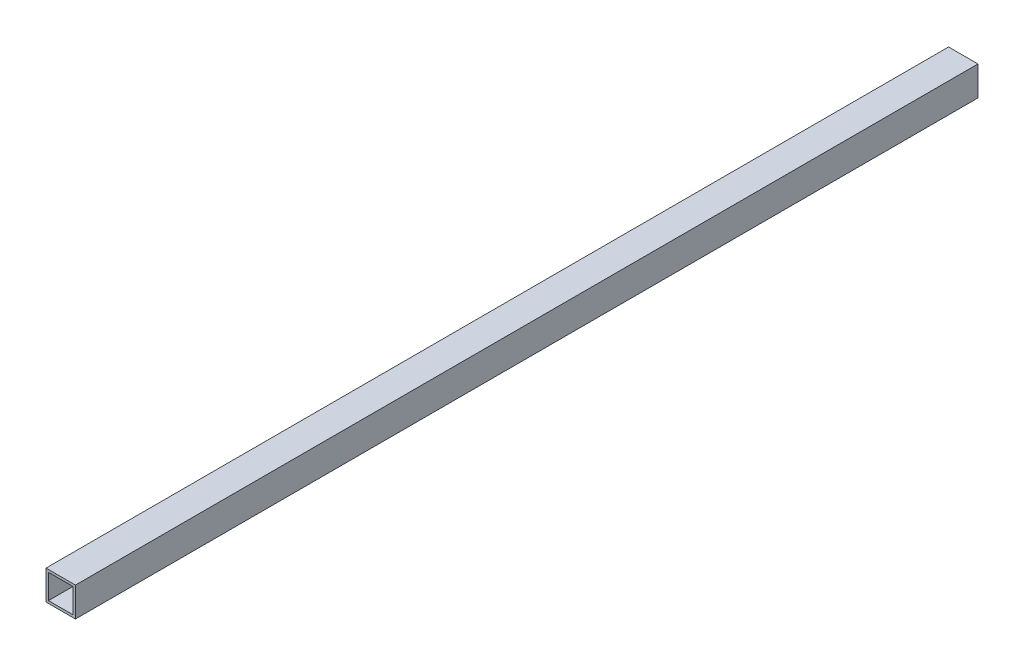
ISO-10303-21;
HEADER;
FILE_DESCRIPTION(('STEP AP214'),'2;1');
FILE_NAME('part.step','',(''),(''),'','','');
FILE_SCHEMA(('AUTOMOTIVE_DESIGN { 1 0 10303 214 1 1 1 1 }'));
ENDSEC;
DATA;
#1=APPLICATION_CONTEXT('core data for automotive mechanical design processes');
#2=APPLICATION_PROTOCOL_DEFINITION('international standard','automotive_design',2000,#1);
#3=PRODUCT_CONTEXT('',#1,'mechanical');
#4=PRODUCT('Part','Part','',(#3));
#5=PRODUCT_RELATED_PRODUCT_CATEGORY('part','',(#4));
#6=PRODUCT_DEFINITION_FORMATION('','',#4);
#7=PRODUCT_DEFINITION_CONTEXT('part definition',#1,'design');
#8=PRODUCT_DEFINITION('design','',#6,#7);
#9=PRODUCT_DEFINITION_SHAPE('','',#8);
#10=(LENGTH_UNIT() NAMED_UNIT(*) SI_UNIT(.MILLI.,.METRE.));
#11=(NAMED_UNIT(*) PLANE_ANGLE_UNIT() SI_UNIT($,.RADIAN.));
#12=(NAMED_UNIT(*) SI_UNIT($,.STERADIAN.) SOLID_ANGLE_UNIT());
#13=UNCERTAINTY_MEASURE_WITH_UNIT(LENGTH_MEASURE(1.E-05),#10,'distance_accuracy_value','');
#14=(GEOMETRIC_REPRESENTATION_CONTEXT(3) GLOBAL_UNCERTAINTY_ASSIGNED_CONTEXT((#13)) GLOBAL_UNIT_ASSIGNED_CONTEXT((#10,
#11,#12)) REPRESENTATION_CONTEXT('',''));
#15=CARTESIAN_POINT('',(0.,0.,0.));
#16=DIRECTION('',(0.,0.,1.));
#17=DIRECTION('',(1.,0.,0.));
#18=AXIS2_PLACEMENT_3D('',#15,#16,#17);
#19=CARTESIAN_POINT('',(-10.259093804746,14.9139194139194,584.2));
#20=DIRECTION('',(0.,1.,0.));
#21=DIRECTION('',(0.,0.,1.));
#22=AXIS2_PLACEMENT_3D('',#19,#20,#21);
#23=PLANE('',#22);
#24=DIRECTION('',(1.,0.,0.));
#25=VECTOR('',#24,1.);
#26=CARTESIAN_POINT('',(-10.259093804746,14.9139194139194,0.));
#27=LINE('',#26,#25);
#28=CARTESIAN_POINT('',(-10.259093804746,14.9139194139194,0.));
#29=VERTEX_POINT('',#28);
#30=CARTESIAN_POINT('',(8.79090619525399,14.9139194139194,0.));
#31=VERTEX_POINT('',#30);
#32=EDGE_CURVE('E131',#29,#31,#27,.T.);
#33=ORIENTED_EDGE('',*,*,#32,.F.);
#34=DIRECTION('',(0.,0.,-1.));
#35=VECTOR('',#34,1.);
#36=CARTESIAN_POINT('',(-10.259093804746,14.9139194139194,584.2));
#37=LINE('',#36,#35);
#38=CARTESIAN_POINT('',(-10.259093804746,14.9139194139194,584.2));
#39=VERTEX_POINT('',#38);
#40=EDGE_CURVE('E11',#39,#29,#37,.T.);
#41=ORIENTED_EDGE('',*,*,#40,.F.);
#42=DIRECTION('',(1.,0.,0.));
#43=VECTOR('',#42,1.);
#44=CARTESIAN_POINT('',(-10.259093804746,14.9139194139194,584.2));
#45=LINE('',#44,#43);
#46=CARTESIAN_POINT('',(8.79090619525399,14.9139194139194,584.2));
#47=VERTEX_POINT('',#46);
#48=EDGE_CURVE('E135',#39,#47,#45,.T.);
#49=ORIENTED_EDGE('',*,*,#48,.T.);
#50=DIRECTION('',(0.,0.,-1.));
#51=VECTOR('',#50,1.);
#52=CARTESIAN_POINT('',(8.79090619525399,14.9139194139194,584.2));
#53=LINE('',#52,#51);
#54=EDGE_CURVE('E36',#47,#31,#53,.T.);
#55=ORIENTED_EDGE('',*,*,#54,.T.);
#56=EDGE_LOOP('',(#33,#41,#49,#55));
#57=FACE_BOUND('',#56,.T.);
#58=ADVANCED_FACE('F33',(#57),#23,.T.);
#59=CARTESIAN_POINT('',(-10.259093804746,14.9139194139194,584.2));
#60=DIRECTION('',(1.,0.,0.));
#61=DIRECTION('',(0.,1.,0.));
#62=AXIS2_PLACEMENT_3D('',#59,#60,#61);
#63=PLANE('',#62);
#64=DIRECTION('',(0.,-1.,0.));
#65=VECTOR('',#64,1.);
#66=CARTESIAN_POINT('',(-10.259093804746,14.9139194139194,0.));
#67=LINE('',#66,#65);
#68=CARTESIAN_POINT('',(-10.259093804746,-4.13608058608059,0.));
#69=VERTEX_POINT('',#68);
#70=EDGE_CURVE('E139',#29,#69,#67,.T.);
#71=ORIENTED_EDGE('',*,*,#70,.T.);
#72=DIRECTION('',(0.,0.,-1.));
#73=VECTOR('',#72,1.);
#74=CARTESIAN_POINT('',(-10.259093804746,-4.13608058608059,584.2));
#75=LINE('',#74,#73);
#76=CARTESIAN_POINT('',(-10.259093804746,-4.13608058608059,584.2));
#77=VERTEX_POINT('',#76);
#78=EDGE_CURVE('E41',#77,#69,#75,.T.);
#79=ORIENTED_EDGE('',*,*,#78,.F.);
#80=DIRECTION('',(0.,-1.,0.));
#81=VECTOR('',#80,1.);
#82=CARTESIAN_POINT('',(-10.259093804746,14.9139194139194,584.2));
#83=LINE('',#82,#81);
#84=EDGE_CURVE('E144',#39,#77,#83,.T.);
#85=ORIENTED_EDGE('',*,*,#84,.F.);
#86=ORIENTED_EDGE('',*,*,#40,.T.);
#87=EDGE_LOOP('',(#71,#79,#85,#86));
#88=FACE_BOUND('',#87,.T.);
#89=ADVANCED_FACE('F171',(#88),#63,.F.);
#90=CARTESIAN_POINT('',(-10.259093804746,-4.13608058608059,584.2));
#91=DIRECTION('',(0.,1.,0.));
#92=DIRECTION('',(-1.,0.,0.));
#93=AXIS2_PLACEMENT_3D('',#90,#91,#92);
#94=PLANE('',#93);
#95=DIRECTION('',(1.,0.,0.));
#96=VECTOR('',#95,1.);
#97=CARTESIAN_POINT('',(-10.259093804746,-4.13608058608059,0.));
#98=LINE('',#97,#96);
#99=CARTESIAN_POINT('',(8.790906195254,-4.13608058608059,0.));
#100=VERTEX_POINT('',#99);
#101=EDGE_CURVE('E151',#69,#100,#98,.T.);
#102=ORIENTED_EDGE('',*,*,#101,.T.);
#103=DIRECTION('',(0.,0.,-1.));
#104=VECTOR('',#103,1.);
#105=CARTESIAN_POINT('',(8.790906195254,-4.13608058608059,584.2));
#106=LINE('',#105,#104);
#107=CARTESIAN_POINT('',(8.790906195254,-4.13608058608059,584.2));
#108=VERTEX_POINT('',#107);
#109=EDGE_CURVE('E156',#108,#100,#106,.T.);
#110=ORIENTED_EDGE('',*,*,#109,.F.);
#111=DIRECTION('',(1.,0.,0.));
#112=VECTOR('',#111,1.);
#113=CARTESIAN_POINT('',(-10.259093804746,-4.13608058608059,584.2));
#114=LINE('',#113,#112);
#115=EDGE_CURVE('E142',#77,#108,#114,.T.);
#116=ORIENTED_EDGE('',*,*,#115,.F.);
#117=ORIENTED_EDGE('',*,*,#78,.T.);
#118=EDGE_LOOP('',(#102,#110,#116,#117));
#119=FACE_BOUND('',#118,.T.);
#120=ADVANCED_FACE('F175',(#119),#94,.F.);
#121=CARTESIAN_POINT('',(8.79090619525399,14.9139194139194,584.2));
#122=DIRECTION('',(1.,0.,0.));
#123=DIRECTION('',(0.,1.,0.));
#124=AXIS2_PLACEMENT_3D('',#121,#122,#123);
#125=PLANE('',#124);
#126=DIRECTION('',(0.,-1.,0.));
#127=VECTOR('',#126,1.);
#128=CARTESIAN_POINT('',(8.79090619525399,14.9139194139194,0.));
#129=LINE('',#128,#127);
#130=EDGE_CURVE('E148',#31,#100,#129,.T.);
#131=ORIENTED_EDGE('',*,*,#130,.F.);
#132=ORIENTED_EDGE('',*,*,#54,.F.);
#133=DIRECTION('',(0.,-1.,0.));
#134=VECTOR('',#133,1.);
#135=CARTESIAN_POINT('',(8.79090619525399,14.9139194139194,584.2));
#136=LINE('',#135,#134);
#137=EDGE_CURVE('E138',#47,#108,#136,.T.);
#138=ORIENTED_EDGE('',*,*,#137,.T.);
#139=ORIENTED_EDGE('',*,*,#109,.T.);
#140=EDGE_LOOP('',(#131,#132,#138,#139));
#141=FACE_BOUND('',#140,.T.);
#142=ADVANCED_FACE('F164',(#141),#125,.T.);
#143=CARTESIAN_POINT('',(0.,0.,584.2));
#144=DIRECTION('',(0.,0.,-1.));
#145=DIRECTION('',(-1.,0.,0.));
#146=AXIS2_PLACEMENT_3D('',#143,#144,#145);
#147=PLANE('',#146);
#148=DIRECTION('',(-1.,0.,0.));
#149=VECTOR('',#148,1.);
#150=CARTESIAN_POINT('',(7.203406195254,-2.54858058608059,584.2));
#151=LINE('',#150,#149);
#152=CARTESIAN_POINT('',(7.203406195254,-2.54858058608059,584.2));
#153=VERTEX_POINT('',#152);
#154=CARTESIAN_POINT('',(-8.671593804746,-2.54858058608059,584.2));
#155=VERTEX_POINT('',#154);
#156=EDGE_CURVE('E106',#153,#155,#151,.T.);
#157=ORIENTED_EDGE('',*,*,#156,.T.);
#158=DIRECTION('',(0.,1.,0.));
#159=VECTOR('',#158,1.);
#160=CARTESIAN_POINT('',(-8.671593804746,-2.54858058608059,584.2));
#161=LINE('',#160,#159);
#162=CARTESIAN_POINT('',(-8.67159380474601,13.3264194139194,584.2));
#163=VERTEX_POINT('',#162);
#164=EDGE_CURVE('E100',#155,#163,#161,.T.);
#165=ORIENTED_EDGE('',*,*,#164,.T.);
#166=DIRECTION('',(1.,0.,0.));
#167=VECTOR('',#166,1.);
#168=CARTESIAN_POINT('',(-8.67159380474601,13.3264194139194,584.2));
#169=LINE('',#168,#167);
#170=CARTESIAN_POINT('',(7.20340619525399,13.3264194139194,584.2));
#171=VERTEX_POINT('',#170);
#172=EDGE_CURVE('E109',#163,#171,#169,.T.);
#173=ORIENTED_EDGE('',*,*,#172,.T.);
#174=DIRECTION('',(0.,-1.,0.));
#175=VECTOR('',#174,1.);
#176=CARTESIAN_POINT('',(7.20340619525399,13.3264194139194,584.2));
#177=LINE('',#176,#175);
#178=EDGE_CURVE('E49',#171,#153,#177,.T.);
#179=ORIENTED_EDGE('',*,*,#178,.T.);
#180=EDGE_LOOP('',(#157,#165,#173,#179));
#181=FACE_BOUND('',#180,.T.);
#182=ORIENTED_EDGE('',*,*,#48,.F.);
#183=ORIENTED_EDGE('',*,*,#84,.T.);
#184=ORIENTED_EDGE('',*,*,#115,.T.);
#185=ORIENTED_EDGE('',*,*,#137,.F.);
#186=EDGE_LOOP('',(#182,#183,#184,#185));
#187=FACE_BOUND('',#186,.T.);
#188=ADVANCED_FACE('F113',(#181,#187),#147,.F.);
#189=CARTESIAN_POINT('',(0.,0.,0.));
#190=DIRECTION('',(0.,0.,-1.));
#191=DIRECTION('',(-1.,0.,0.));
#192=AXIS2_PLACEMENT_3D('',#189,#190,#191);
#193=PLANE('',#192);
#194=DIRECTION('',(0.,1.,0.));
#195=VECTOR('',#194,1.);
#196=CARTESIAN_POINT('',(-8.671593804746,-2.54858058608059,0.));
#197=LINE('',#196,#195);
#198=CARTESIAN_POINT('',(-8.671593804746,-2.54858058608059,0.));
#199=VERTEX_POINT('',#198);
#200=CARTESIAN_POINT('',(-8.67159380474601,13.3264194139194,0.));
#201=VERTEX_POINT('',#200);
#202=EDGE_CURVE('E57',#199,#201,#197,.T.);
#203=ORIENTED_EDGE('',*,*,#202,.F.);
#204=DIRECTION('',(-1.,0.,0.));
#205=VECTOR('',#204,1.);
#206=CARTESIAN_POINT('',(7.203406195254,-2.54858058608059,0.));
#207=LINE('',#206,#205);
#208=CARTESIAN_POINT('',(7.203406195254,-2.54858058608059,0.));
#209=VERTEX_POINT('',#208);
#210=EDGE_CURVE('E116',#209,#199,#207,.T.);
#211=ORIENTED_EDGE('',*,*,#210,.F.);
#212=DIRECTION('',(0.,-1.,0.));
#213=VECTOR('',#212,1.);
#214=CARTESIAN_POINT('',(7.20340619525399,13.3264194139194,0.));
#215=LINE('',#214,#213);
#216=CARTESIAN_POINT('',(7.20340619525399,13.3264194139194,0.));
#217=VERTEX_POINT('',#216);
#218=EDGE_CURVE('E119',#217,#209,#215,.T.);
#219=ORIENTED_EDGE('',*,*,#218,.F.);
#220=DIRECTION('',(1.,0.,0.));
#221=VECTOR('',#220,1.);
#222=CARTESIAN_POINT('',(-8.67159380474601,13.3264194139194,0.));
#223=LINE('',#222,#221);
#224=EDGE_CURVE('E125',#201,#217,#223,.T.);
#225=ORIENTED_EDGE('',*,*,#224,.F.);
#226=EDGE_LOOP('',(#203,#211,#219,#225));
#227=FACE_BOUND('',#226,.T.);
#228=ORIENTED_EDGE('',*,*,#32,.T.);
#229=ORIENTED_EDGE('',*,*,#130,.T.);
#230=ORIENTED_EDGE('',*,*,#101,.F.);
#231=ORIENTED_EDGE('',*,*,#70,.F.);
#232=EDGE_LOOP('',(#228,#229,#230,#231));
#233=FACE_BOUND('',#232,.T.);
#234=ADVANCED_FACE('F168',(#227,#233),#193,.T.);
#235=CARTESIAN_POINT('',(-8.671593804746,-2.54858058608059,584.2));
#236=DIRECTION('',(-1.,0.,0.));
#237=DIRECTION('',(0.,-1.,0.));
#238=AXIS2_PLACEMENT_3D('',#235,#236,#237);
#239=PLANE('',#238);
#240=ORIENTED_EDGE('',*,*,#202,.T.);
#241=DIRECTION('',(0.,0.,-1.));
#242=VECTOR('',#241,1.);
#243=CARTESIAN_POINT('',(-8.67159380474601,13.3264194139194,584.2));
#244=LINE('',#243,#242);
#245=EDGE_CURVE('E96',#163,#201,#244,.T.);
#246=ORIENTED_EDGE('',*,*,#245,.F.);
#247=ORIENTED_EDGE('',*,*,#164,.F.);
#248=DIRECTION('',(0.,0.,-1.));
#249=VECTOR('',#248,1.);
#250=CARTESIAN_POINT('',(-8.671593804746,-2.54858058608059,584.2));
#251=LINE('',#250,#249);
#252=EDGE_CURVE('E129',#155,#199,#251,.T.);
#253=ORIENTED_EDGE('',*,*,#252,.T.);
#254=EDGE_LOOP('',(#240,#246,#247,#253));
#255=FACE_BOUND('',#254,.T.);
#256=ADVANCED_FACE('F98',(#255),#239,.F.);
#257=CARTESIAN_POINT('',(7.203406195254,-2.54858058608059,584.2));
#258=DIRECTION('',(0.,-1.,0.));
#259=DIRECTION('',(1.,0.,0.));
#260=AXIS2_PLACEMENT_3D('',#257,#258,#259);
#261=PLANE('',#260);
#262=ORIENTED_EDGE('',*,*,#210,.T.);
#263=ORIENTED_EDGE('',*,*,#252,.F.);
#264=ORIENTED_EDGE('',*,*,#156,.F.);
#265=DIRECTION('',(0.,0.,-1.));
#266=VECTOR('',#265,1.);
#267=CARTESIAN_POINT('',(7.203406195254,-2.54858058608059,584.2));
#268=LINE('',#267,#266);
#269=EDGE_CURVE('E132',#153,#209,#268,.T.);
#270=ORIENTED_EDGE('',*,*,#269,.T.);
#271=EDGE_LOOP('',(#262,#263,#264,#270));
#272=FACE_BOUND('',#271,.T.);
#273=ADVANCED_FACE('F219',(#272),#261,.F.);
#274=CARTESIAN_POINT('',(7.20340619525399,13.3264194139194,584.2));
#275=DIRECTION('',(1.,0.,0.));
#276=DIRECTION('',(0.,1.,0.));
#277=AXIS2_PLACEMENT_3D('',#274,#275,#276);
#278=PLANE('',#277);
#279=ORIENTED_EDGE('',*,*,#218,.T.);
#280=ORIENTED_EDGE('',*,*,#269,.F.);
#281=ORIENTED_EDGE('',*,*,#178,.F.);
#282=DIRECTION('',(0.,0.,-1.));
#283=VECTOR('',#282,1.);
#284=CARTESIAN_POINT('',(7.20340619525399,13.3264194139194,584.2));
#285=LINE('',#284,#283);
#286=EDGE_CURVE('E105',#171,#217,#285,.T.);
#287=ORIENTED_EDGE('',*,*,#286,.T.);
#288=EDGE_LOOP('',(#279,#280,#281,#287));
#289=FACE_BOUND('',#288,.T.);
#290=ADVANCED_FACE('F227',(#289),#278,.F.);
#291=CARTESIAN_POINT('',(-8.67159380474601,13.3264194139194,584.2));
#292=DIRECTION('',(0.,1.,0.));
#293=DIRECTION('',(0.,0.,1.));
#294=AXIS2_PLACEMENT_3D('',#291,#292,#293);
#295=PLANE('',#294);
#296=ORIENTED_EDGE('',*,*,#224,.T.);
#297=ORIENTED_EDGE('',*,*,#286,.F.);
#298=ORIENTED_EDGE('',*,*,#172,.F.);
#299=ORIENTED_EDGE('',*,*,#245,.T.);
#300=EDGE_LOOP('',(#296,#297,#298,#299));
#301=FACE_BOUND('',#300,.T.);
#302=ADVANCED_FACE('F110',(#301),#295,.F.);
#303=CLOSED_SHELL('',(#58,#89,#120,#142,#188,#234,#256,#273,#290,#302));
#304=MANIFOLD_SOLID_BREP('B2',#303);
#305=ADVANCED_BREP_SHAPE_REPRESENTATION('',(#18,#304),#14);
#306=SHAPE_DEFINITION_REPRESENTATION(#9,#305);
ENDSEC;
END-ISO-10303-21;
